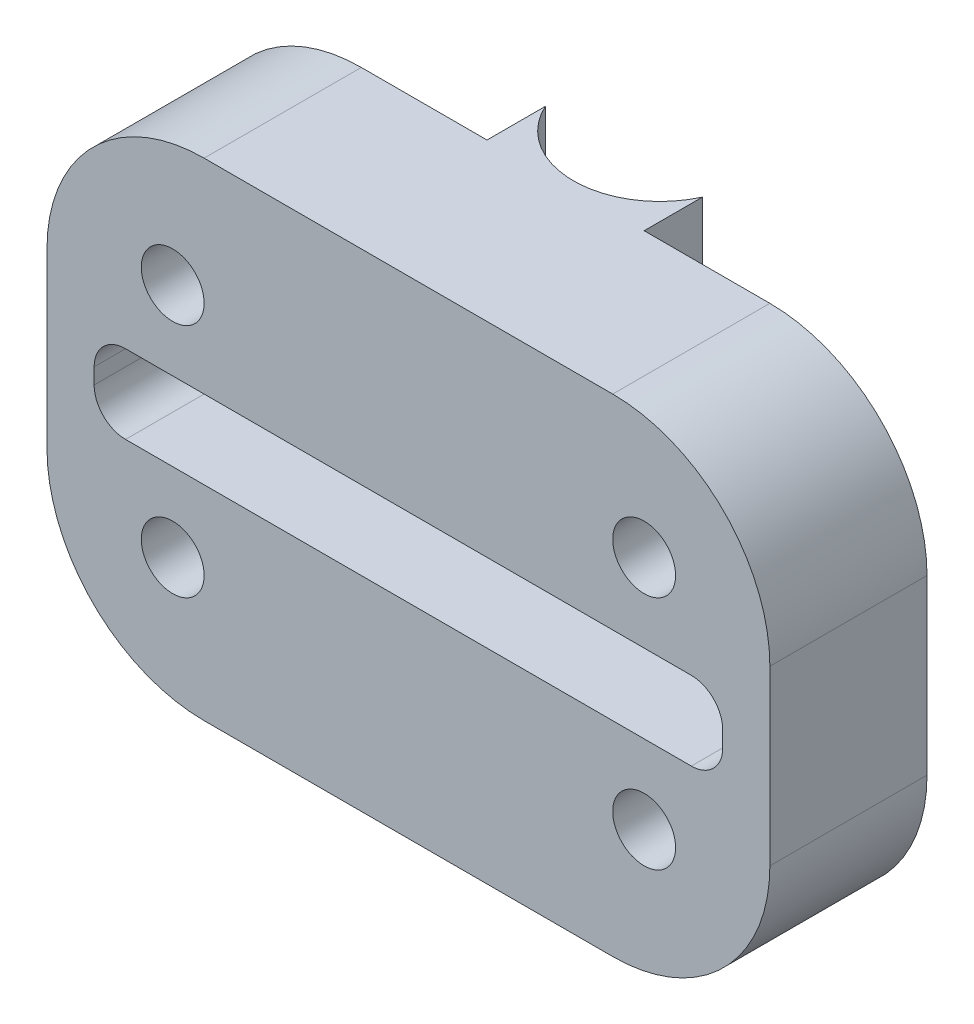
ISO-10303-21;
HEADER;
FILE_DESCRIPTION(('STEP AP214'),'2;1');
FILE_NAME('part.step','',(''),(''),'','','');
FILE_SCHEMA(('AUTOMOTIVE_DESIGN { 1 0 10303 214 1 1 1 1 }'));
ENDSEC;
DATA;
#1=APPLICATION_CONTEXT('core data for automotive mechanical design processes');
#2=APPLICATION_PROTOCOL_DEFINITION('international standard','automotive_design',2000,#1);
#3=PRODUCT_CONTEXT('',#1,'mechanical');
#4=PRODUCT('Part','Part','',(#3));
#5=PRODUCT_RELATED_PRODUCT_CATEGORY('part','',(#4));
#6=PRODUCT_DEFINITION_FORMATION('','',#4);
#7=PRODUCT_DEFINITION_CONTEXT('part definition',#1,'design');
#8=PRODUCT_DEFINITION('design','',#6,#7);
#9=PRODUCT_DEFINITION_SHAPE('','',#8);
#10=(LENGTH_UNIT() NAMED_UNIT(*) SI_UNIT(.MILLI.,.METRE.));
#11=(NAMED_UNIT(*) PLANE_ANGLE_UNIT() SI_UNIT($,.RADIAN.));
#12=(NAMED_UNIT(*) SI_UNIT($,.STERADIAN.) SOLID_ANGLE_UNIT());
#13=UNCERTAINTY_MEASURE_WITH_UNIT(LENGTH_MEASURE(1.E-05),#10,'distance_accuracy_value','');
#14=(GEOMETRIC_REPRESENTATION_CONTEXT(3) GLOBAL_UNCERTAINTY_ASSIGNED_CONTEXT((#13)) GLOBAL_UNIT_ASSIGNED_CONTEXT((#10,
#11,#12)) REPRESENTATION_CONTEXT('',''));
#15=CARTESIAN_POINT('',(0.,0.,0.));
#16=DIRECTION('',(0.,0.,1.));
#17=DIRECTION('',(1.,0.,0.));
#18=AXIS2_PLACEMENT_3D('',#15,#16,#17);
#19=CARTESIAN_POINT('',(0.,0.,0.));
#20=DIRECTION('',(0.,0.,1.));
#21=DIRECTION('',(1.,0.,0.));
#22=AXIS2_PLACEMENT_3D('',#19,#20,#21);
#23=PLANE('',#22);
#24=DIRECTION('',(0.,1.,0.));
#25=VECTOR('',#24,1.);
#26=CARTESIAN_POINT('',(20.,0.,0.));
#27=LINE('',#26,#25);
#28=CARTESIAN_POINT('',(20.,-0.5,0.));
#29=VERTEX_POINT('',#28);
#30=CARTESIAN_POINT('',(20.,0.5,0.));
#31=VERTEX_POINT('',#30);
#32=EDGE_CURVE('E387',#29,#31,#27,.T.);
#33=ORIENTED_EDGE('',*,*,#32,.T.);
#34=CARTESIAN_POINT('',(18.,0.5,0.));
#35=DIRECTION('',(0.,0.,1.));
#36=DIRECTION('',(1.,0.,0.));
#37=AXIS2_PLACEMENT_3D('',#34,#35,#36);
#38=CIRCLE('',#37,2.);
#39=CARTESIAN_POINT('',(18.,2.5,0.));
#40=VERTEX_POINT('',#39);
#41=EDGE_CURVE('E58',#31,#40,#38,.T.);
#42=ORIENTED_EDGE('',*,*,#41,.T.);
#43=DIRECTION('',(-1.,0.,0.));
#44=VECTOR('',#43,1.);
#45=CARTESIAN_POINT('',(0.,2.5,0.));
#46=LINE('',#45,#44);
#47=CARTESIAN_POINT('',(-18.,2.5,0.));
#48=VERTEX_POINT('',#47);
#49=EDGE_CURVE('E398',#40,#48,#46,.T.);
#50=ORIENTED_EDGE('',*,*,#49,.T.);
#51=CARTESIAN_POINT('',(-18.,0.5,0.));
#52=DIRECTION('',(0.,0.,1.));
#53=DIRECTION('',(1.,0.,0.));
#54=AXIS2_PLACEMENT_3D('',#51,#52,#53);
#55=CIRCLE('',#54,2.);
#56=CARTESIAN_POINT('',(-20.,0.5,0.));
#57=VERTEX_POINT('',#56);
#58=EDGE_CURVE('E50',#48,#57,#55,.T.);
#59=ORIENTED_EDGE('',*,*,#58,.T.);
#60=DIRECTION('',(0.,-1.,0.));
#61=VECTOR('',#60,1.);
#62=CARTESIAN_POINT('',(-20.,0.,0.));
#63=LINE('',#62,#61);
#64=CARTESIAN_POINT('',(-20.,-0.5,0.));
#65=VERTEX_POINT('',#64);
#66=EDGE_CURVE('E231',#57,#65,#63,.T.);
#67=ORIENTED_EDGE('',*,*,#66,.T.);
#68=CARTESIAN_POINT('',(-18.,-0.5,0.));
#69=DIRECTION('',(0.,0.,1.));
#70=DIRECTION('',(1.,0.,0.));
#71=AXIS2_PLACEMENT_3D('',#68,#69,#70);
#72=CIRCLE('',#71,2.);
#73=CARTESIAN_POINT('',(-18.,-2.5,0.));
#74=VERTEX_POINT('',#73);
#75=EDGE_CURVE('E375',#65,#74,#72,.T.);
#76=ORIENTED_EDGE('',*,*,#75,.T.);
#77=DIRECTION('',(1.,0.,0.));
#78=VECTOR('',#77,1.);
#79=CARTESIAN_POINT('',(0.,-2.5,0.));
#80=LINE('',#79,#78);
#81=CARTESIAN_POINT('',(18.,-2.5,0.));
#82=VERTEX_POINT('',#81);
#83=EDGE_CURVE('E389',#74,#82,#80,.T.);
#84=ORIENTED_EDGE('',*,*,#83,.T.);
#85=CARTESIAN_POINT('',(18.,-0.5,0.));
#86=DIRECTION('',(0.,0.,1.));
#87=DIRECTION('',(1.,0.,0.));
#88=AXIS2_PLACEMENT_3D('',#85,#86,#87);
#89=CIRCLE('',#88,2.);
#90=EDGE_CURVE('E43',#82,#29,#89,.T.);
#91=ORIENTED_EDGE('',*,*,#90,.T.);
#92=EDGE_LOOP('',(#33,#42,#50,#59,#67,#76,#84,#91));
#93=FACE_BOUND('',#92,.T.);
#94=CARTESIAN_POINT('',(-15.,7.5,0.));
#95=DIRECTION('',(0.,0.,1.));
#96=DIRECTION('',(1.,0.,0.));
#97=AXIS2_PLACEMENT_3D('',#94,#95,#96);
#98=CIRCLE('',#97,2.);
#99=CARTESIAN_POINT('',(-13.,7.5,0.));
#100=VERTEX_POINT('',#99);
#101=EDGE_CURVE('E284',#100,#100,#98,.T.);
#102=ORIENTED_EDGE('',*,*,#101,.T.);
#103=EDGE_LOOP('',(#102));
#104=FACE_BOUND('',#103,.T.);
#105=CARTESIAN_POINT('',(15.,7.5,0.));
#106=DIRECTION('',(0.,0.,1.));
#107=DIRECTION('',(1.,0.,0.));
#108=AXIS2_PLACEMENT_3D('',#105,#106,#107);
#109=CIRCLE('',#108,2.);
#110=CARTESIAN_POINT('',(17.,7.5,0.));
#111=VERTEX_POINT('',#110);
#112=EDGE_CURVE('E278',#111,#111,#109,.T.);
#113=ORIENTED_EDGE('',*,*,#112,.T.);
#114=EDGE_LOOP('',(#113));
#115=FACE_BOUND('',#114,.T.);
#116=CARTESIAN_POINT('',(15.,-7.5,0.));
#117=DIRECTION('',(0.,0.,1.));
#118=DIRECTION('',(1.,0.,0.));
#119=AXIS2_PLACEMENT_3D('',#116,#117,#118);
#120=CIRCLE('',#119,2.);
#121=CARTESIAN_POINT('',(17.,-7.5,0.));
#122=VERTEX_POINT('',#121);
#123=EDGE_CURVE('E272',#122,#122,#120,.T.);
#124=ORIENTED_EDGE('',*,*,#123,.T.);
#125=EDGE_LOOP('',(#124));
#126=FACE_BOUND('',#125,.T.);
#127=CARTESIAN_POINT('',(-15.,-7.5,0.));
#128=DIRECTION('',(0.,0.,1.));
#129=DIRECTION('',(1.,0.,0.));
#130=AXIS2_PLACEMENT_3D('',#127,#128,#129);
#131=CIRCLE('',#130,2.);
#132=CARTESIAN_POINT('',(-13.,-7.5,0.));
#133=VERTEX_POINT('',#132);
#134=EDGE_CURVE('E262',#133,#133,#131,.T.);
#135=ORIENTED_EDGE('',*,*,#134,.T.);
#136=EDGE_LOOP('',(#135));
#137=FACE_BOUND('',#136,.T.);
#138=DIRECTION('',(0.,-1.,0.));
#139=VECTOR('',#138,1.);
#140=CARTESIAN_POINT('',(5.,-5.5,0.));
#141=LINE('',#140,#139);
#142=CARTESIAN_POINT('',(5.,-5.5,0.));
#143=VERTEX_POINT('',#142);
#144=CARTESIAN_POINT('',(5.,-15.5,0.));
#145=VERTEX_POINT('',#144);
#146=EDGE_CURVE('E228',#143,#145,#141,.T.);
#147=ORIENTED_EDGE('',*,*,#146,.F.);
#148=DIRECTION('',(1.,0.,0.));
#149=VECTOR('',#148,1.);
#150=CARTESIAN_POINT('',(-23.,-5.5,0.));
#151=LINE('',#150,#149);
#152=CARTESIAN_POINT('',(-5.,-5.5,0.));
#153=VERTEX_POINT('',#152);
#154=EDGE_CURVE('E205',#153,#143,#151,.T.);
#155=ORIENTED_EDGE('',*,*,#154,.F.);
#156=DIRECTION('',(0.,-1.,0.));
#157=VECTOR('',#156,1.);
#158=CARTESIAN_POINT('',(-5.,-5.5,0.));
#159=LINE('',#158,#157);
#160=CARTESIAN_POINT('',(-5.,-15.5,0.));
#161=VERTEX_POINT('',#160);
#162=EDGE_CURVE('E236',#153,#161,#159,.T.);
#163=ORIENTED_EDGE('',*,*,#162,.T.);
#164=DIRECTION('',(1.,0.,0.));
#165=VECTOR('',#164,1.);
#166=CARTESIAN_POINT('',(-23.,-15.5,0.));
#167=LINE('',#166,#165);
#168=CARTESIAN_POINT('',(-13.,-15.5,0.));
#169=VERTEX_POINT('',#168);
#170=EDGE_CURVE('E297',#169,#161,#167,.T.);
#171=ORIENTED_EDGE('',*,*,#170,.F.);
#172=CARTESIAN_POINT('',(-13.,-5.5,0.));
#173=DIRECTION('',(0.,0.,1.));
#174=DIRECTION('',(1.,0.,0.));
#175=AXIS2_PLACEMENT_3D('',#172,#173,#174);
#176=CIRCLE('',#175,10.);
#177=CARTESIAN_POINT('',(-23.,-5.49999999999999,0.));
#178=VERTEX_POINT('',#177);
#179=EDGE_CURVE('E323',#169,#178,#176,.F.);
#180=ORIENTED_EDGE('',*,*,#179,.T.);
#181=DIRECTION('',(0.,-1.,0.));
#182=VECTOR('',#181,1.);
#183=CARTESIAN_POINT('',(-23.,15.5,0.));
#184=LINE('',#183,#182);
#185=CARTESIAN_POINT('',(-23.,5.5,0.));
#186=VERTEX_POINT('',#185);
#187=EDGE_CURVE('E313',#186,#178,#184,.T.);
#188=ORIENTED_EDGE('',*,*,#187,.F.);
#189=CARTESIAN_POINT('',(-13.,5.5,0.));
#190=DIRECTION('',(0.,0.,1.));
#191=DIRECTION('',(1.,0.,0.));
#192=AXIS2_PLACEMENT_3D('',#189,#190,#191);
#193=CIRCLE('',#192,10.);
#194=CARTESIAN_POINT('',(-13.,15.5,0.));
#195=VERTEX_POINT('',#194);
#196=EDGE_CURVE('E330',#186,#195,#193,.F.);
#197=ORIENTED_EDGE('',*,*,#196,.T.);
#198=DIRECTION('',(-1.,0.,0.));
#199=VECTOR('',#198,1.);
#200=CARTESIAN_POINT('',(-23.,15.5,0.));
#201=LINE('',#200,#199);
#202=CARTESIAN_POINT('',(-5.,15.5,0.));
#203=VERTEX_POINT('',#202);
#204=EDGE_CURVE('E309',#203,#195,#201,.T.);
#205=ORIENTED_EDGE('',*,*,#204,.F.);
#206=DIRECTION('',(0.,1.,0.));
#207=VECTOR('',#206,1.);
#208=CARTESIAN_POINT('',(-5.,5.5,0.));
#209=LINE('',#208,#207);
#210=CARTESIAN_POINT('',(-5.,5.5,0.));
#211=VERTEX_POINT('',#210);
#212=EDGE_CURVE('E266',#211,#203,#209,.T.);
#213=ORIENTED_EDGE('',*,*,#212,.F.);
#214=DIRECTION('',(1.,0.,0.));
#215=VECTOR('',#214,1.);
#216=CARTESIAN_POINT('',(-23.,5.5,0.));
#217=LINE('',#216,#215);
#218=CARTESIAN_POINT('',(5.,5.5,0.));
#219=VERTEX_POINT('',#218);
#220=EDGE_CURVE('E246',#211,#219,#217,.T.);
#221=ORIENTED_EDGE('',*,*,#220,.T.);
#222=DIRECTION('',(0.,1.,0.));
#223=VECTOR('',#222,1.);
#224=CARTESIAN_POINT('',(5.,5.5,0.));
#225=LINE('',#224,#223);
#226=CARTESIAN_POINT('',(5.,15.5,0.));
#227=VERTEX_POINT('',#226);
#228=EDGE_CURVE('E263',#219,#227,#225,.T.);
#229=ORIENTED_EDGE('',*,*,#228,.T.);
#230=CARTESIAN_POINT('',(13.,15.5,0.));
#231=VERTEX_POINT('',#230);
#232=EDGE_CURVE('E310',#231,#227,#201,.T.);
#233=ORIENTED_EDGE('',*,*,#232,.F.);
#234=CARTESIAN_POINT('',(13.,5.5,0.));
#235=DIRECTION('',(0.,0.,1.));
#236=DIRECTION('',(1.,0.,0.));
#237=AXIS2_PLACEMENT_3D('',#234,#235,#236);
#238=CIRCLE('',#237,10.);
#239=CARTESIAN_POINT('',(23.,5.50000000000001,0.));
#240=VERTEX_POINT('',#239);
#241=EDGE_CURVE('E328',#231,#240,#238,.F.);
#242=ORIENTED_EDGE('',*,*,#241,.T.);
#243=DIRECTION('',(0.,1.,0.));
#244=VECTOR('',#243,1.);
#245=CARTESIAN_POINT('',(23.,15.5,0.));
#246=LINE('',#245,#244);
#247=CARTESIAN_POINT('',(23.,-5.49999999999999,0.));
#248=VERTEX_POINT('',#247);
#249=EDGE_CURVE('E290',#248,#240,#246,.T.);
#250=ORIENTED_EDGE('',*,*,#249,.F.);
#251=CARTESIAN_POINT('',(13.,-5.5,0.));
#252=DIRECTION('',(0.,0.,1.));
#253=DIRECTION('',(1.,0.,0.));
#254=AXIS2_PLACEMENT_3D('',#251,#252,#253);
#255=CIRCLE('',#254,10.);
#256=CARTESIAN_POINT('',(13.,-15.5,0.));
#257=VERTEX_POINT('',#256);
#258=EDGE_CURVE('E325',#248,#257,#255,.F.);
#259=ORIENTED_EDGE('',*,*,#258,.T.);
#260=EDGE_CURVE('E316',#145,#257,#167,.T.);
#261=ORIENTED_EDGE('',*,*,#260,.F.);
#262=EDGE_LOOP('',(#147,#155,#163,#171,#180,#188,#197,#205,#213,#221,#229,#233,#242,#250,#259,#261));
#263=FACE_BOUND('',#262,.T.);
#264=ADVANCED_FACE('F35',(#93,#104,#115,#126,#137,#263),#23,.F.);
#265=CARTESIAN_POINT('',(0.,0.,10.));
#266=DIRECTION('',(0.,0.,1.));
#267=DIRECTION('',(1.,0.,0.));
#268=AXIS2_PLACEMENT_3D('',#265,#266,#267);
#269=PLANE('',#268);
#270=DIRECTION('',(-1.,0.,0.));
#271=VECTOR('',#270,1.);
#272=CARTESIAN_POINT('',(20.,-2.5,10.));
#273=LINE('',#272,#271);
#274=CARTESIAN_POINT('',(18.,-2.5,10.));
#275=VERTEX_POINT('',#274);
#276=CARTESIAN_POINT('',(-18.,-2.5,10.));
#277=VERTEX_POINT('',#276);
#278=EDGE_CURVE('E406',#275,#277,#273,.T.);
#279=ORIENTED_EDGE('',*,*,#278,.T.);
#280=CARTESIAN_POINT('',(-18.,-0.5,10.));
#281=DIRECTION('',(0.,0.,1.));
#282=DIRECTION('',(1.,0.,0.));
#283=AXIS2_PLACEMENT_3D('',#280,#281,#282);
#284=CIRCLE('',#283,2.);
#285=CARTESIAN_POINT('',(-20.,-0.5,10.));
#286=VERTEX_POINT('',#285);
#287=EDGE_CURVE('E377',#277,#286,#284,.F.);
#288=ORIENTED_EDGE('',*,*,#287,.T.);
#289=DIRECTION('',(0.,1.,0.));
#290=VECTOR('',#289,1.);
#291=CARTESIAN_POINT('',(-20.,2.5,10.));
#292=LINE('',#291,#290);
#293=CARTESIAN_POINT('',(-20.,0.5,10.));
#294=VERTEX_POINT('',#293);
#295=EDGE_CURVE('E430',#286,#294,#292,.T.);
#296=ORIENTED_EDGE('',*,*,#295,.T.);
#297=CARTESIAN_POINT('',(-18.,0.5,10.));
#298=DIRECTION('',(0.,0.,1.));
#299=DIRECTION('',(1.,0.,0.));
#300=AXIS2_PLACEMENT_3D('',#297,#298,#299);
#301=CIRCLE('',#300,2.);
#302=CARTESIAN_POINT('',(-18.,2.5,10.));
#303=VERTEX_POINT('',#302);
#304=EDGE_CURVE('E383',#294,#303,#301,.F.);
#305=ORIENTED_EDGE('',*,*,#304,.T.);
#306=DIRECTION('',(1.,0.,0.));
#307=VECTOR('',#306,1.);
#308=CARTESIAN_POINT('',(20.,2.5,10.));
#309=LINE('',#308,#307);
#310=CARTESIAN_POINT('',(18.,2.5,10.));
#311=VERTEX_POINT('',#310);
#312=EDGE_CURVE('E414',#303,#311,#309,.T.);
#313=ORIENTED_EDGE('',*,*,#312,.T.);
#314=CARTESIAN_POINT('',(18.,0.5,10.));
#315=DIRECTION('',(0.,0.,1.));
#316=DIRECTION('',(1.,0.,0.));
#317=AXIS2_PLACEMENT_3D('',#314,#315,#316);
#318=CIRCLE('',#317,2.);
#319=CARTESIAN_POINT('',(20.,0.5,10.));
#320=VERTEX_POINT('',#319);
#321=EDGE_CURVE('E380',#311,#320,#318,.F.);
#322=ORIENTED_EDGE('',*,*,#321,.T.);
#323=DIRECTION('',(0.,-1.,0.));
#324=VECTOR('',#323,1.);
#325=CARTESIAN_POINT('',(20.,2.5,10.));
#326=LINE('',#325,#324);
#327=CARTESIAN_POINT('',(20.,-0.5,10.));
#328=VERTEX_POINT('',#327);
#329=EDGE_CURVE('E408',#320,#328,#326,.T.);
#330=ORIENTED_EDGE('',*,*,#329,.T.);
#331=CARTESIAN_POINT('',(18.,-0.5,10.));
#332=DIRECTION('',(0.,0.,1.));
#333=DIRECTION('',(1.,0.,0.));
#334=AXIS2_PLACEMENT_3D('',#331,#332,#333);
#335=CIRCLE('',#334,2.);
#336=EDGE_CURVE('E11',#328,#275,#335,.F.);
#337=ORIENTED_EDGE('',*,*,#336,.T.);
#338=EDGE_LOOP('',(#279,#288,#296,#305,#313,#322,#330,#337));
#339=FACE_BOUND('',#338,.T.);
#340=CARTESIAN_POINT('',(15.,-7.5,10.));
#341=DIRECTION('',(0.,0.,1.));
#342=DIRECTION('',(1.,0.,0.));
#343=AXIS2_PLACEMENT_3D('',#340,#341,#342);
#344=CIRCLE('',#343,2.);
#345=CARTESIAN_POINT('',(17.,-7.5,10.));
#346=VERTEX_POINT('',#345);
#347=EDGE_CURVE('E275',#346,#346,#344,.T.);
#348=ORIENTED_EDGE('',*,*,#347,.F.);
#349=EDGE_LOOP('',(#348));
#350=FACE_BOUND('',#349,.T.);
#351=CARTESIAN_POINT('',(-15.,7.5,10.));
#352=DIRECTION('',(0.,0.,1.));
#353=DIRECTION('',(1.,0.,0.));
#354=AXIS2_PLACEMENT_3D('',#351,#352,#353);
#355=CIRCLE('',#354,2.);
#356=CARTESIAN_POINT('',(-13.,7.5,10.));
#357=VERTEX_POINT('',#356);
#358=EDGE_CURVE('E287',#357,#357,#355,.T.);
#359=ORIENTED_EDGE('',*,*,#358,.F.);
#360=EDGE_LOOP('',(#359));
#361=FACE_BOUND('',#360,.T.);
#362=DIRECTION('',(-1.,0.,0.));
#363=VECTOR('',#362,1.);
#364=CARTESIAN_POINT('',(-23.,15.5,10.));
#365=LINE('',#364,#363);
#366=CARTESIAN_POINT('',(13.,15.5,10.));
#367=VERTEX_POINT('',#366);
#368=CARTESIAN_POINT('',(-13.,15.5,10.));
#369=VERTEX_POINT('',#368);
#370=EDGE_CURVE('E296',#367,#369,#365,.T.);
#371=ORIENTED_EDGE('',*,*,#370,.T.);
#372=CARTESIAN_POINT('',(-13.,5.5,10.));
#373=DIRECTION('',(0.,0.,1.));
#374=DIRECTION('',(1.,0.,0.));
#375=AXIS2_PLACEMENT_3D('',#372,#373,#374);
#376=CIRCLE('',#375,10.);
#377=CARTESIAN_POINT('',(-23.,5.5,10.));
#378=VERTEX_POINT('',#377);
#379=EDGE_CURVE('E344',#369,#378,#376,.T.);
#380=ORIENTED_EDGE('',*,*,#379,.T.);
#381=DIRECTION('',(0.,-1.,0.));
#382=VECTOR('',#381,1.);
#383=CARTESIAN_POINT('',(-23.,15.5,10.));
#384=LINE('',#383,#382);
#385=CARTESIAN_POINT('',(-23.,-5.49999999999999,10.));
#386=VERTEX_POINT('',#385);
#387=EDGE_CURVE('E300',#378,#386,#384,.T.);
#388=ORIENTED_EDGE('',*,*,#387,.T.);
#389=CARTESIAN_POINT('',(-13.,-5.5,10.));
#390=DIRECTION('',(0.,0.,1.));
#391=DIRECTION('',(1.,0.,0.));
#392=AXIS2_PLACEMENT_3D('',#389,#390,#391);
#393=CIRCLE('',#392,10.);
#394=CARTESIAN_POINT('',(-13.,-15.5,10.));
#395=VERTEX_POINT('',#394);
#396=EDGE_CURVE('E338',#386,#395,#393,.T.);
#397=ORIENTED_EDGE('',*,*,#396,.T.);
#398=DIRECTION('',(1.,0.,0.));
#399=VECTOR('',#398,1.);
#400=CARTESIAN_POINT('',(-23.,-15.5,10.));
#401=LINE('',#400,#399);
#402=CARTESIAN_POINT('',(13.,-15.5,10.));
#403=VERTEX_POINT('',#402);
#404=EDGE_CURVE('E303',#395,#403,#401,.T.);
#405=ORIENTED_EDGE('',*,*,#404,.T.);
#406=CARTESIAN_POINT('',(13.,-5.5,10.));
#407=DIRECTION('',(0.,0.,1.));
#408=DIRECTION('',(1.,0.,0.));
#409=AXIS2_PLACEMENT_3D('',#406,#407,#408);
#410=CIRCLE('',#409,10.);
#411=CARTESIAN_POINT('',(23.,-5.49999999999999,10.));
#412=VERTEX_POINT('',#411);
#413=EDGE_CURVE('E340',#403,#412,#410,.T.);
#414=ORIENTED_EDGE('',*,*,#413,.T.);
#415=DIRECTION('',(0.,1.,0.));
#416=VECTOR('',#415,1.);
#417=CARTESIAN_POINT('',(23.,15.5,10.));
#418=LINE('',#417,#416);
#419=CARTESIAN_POINT('',(23.,5.50000000000001,10.));
#420=VERTEX_POINT('',#419);
#421=EDGE_CURVE('E293',#412,#420,#418,.T.);
#422=ORIENTED_EDGE('',*,*,#421,.T.);
#423=CARTESIAN_POINT('',(13.,5.5,10.));
#424=DIRECTION('',(0.,0.,1.));
#425=DIRECTION('',(1.,0.,0.));
#426=AXIS2_PLACEMENT_3D('',#423,#424,#425);
#427=CIRCLE('',#426,10.);
#428=EDGE_CURVE('E342',#420,#367,#427,.T.);
#429=ORIENTED_EDGE('',*,*,#428,.T.);
#430=EDGE_LOOP('',(#371,#380,#388,#397,#405,#414,#422,#429));
#431=FACE_BOUND('',#430,.T.);
#432=CARTESIAN_POINT('',(15.,7.5,10.));
#433=DIRECTION('',(0.,0.,1.));
#434=DIRECTION('',(1.,0.,0.));
#435=AXIS2_PLACEMENT_3D('',#432,#433,#434);
#436=CIRCLE('',#435,2.);
#437=CARTESIAN_POINT('',(17.,7.5,10.));
#438=VERTEX_POINT('',#437);
#439=EDGE_CURVE('E281',#438,#438,#436,.T.);
#440=ORIENTED_EDGE('',*,*,#439,.F.);
#441=EDGE_LOOP('',(#440));
#442=FACE_BOUND('',#441,.T.);
#443=CARTESIAN_POINT('',(-15.,-7.5,10.));
#444=DIRECTION('',(0.,0.,1.));
#445=DIRECTION('',(1.,0.,0.));
#446=AXIS2_PLACEMENT_3D('',#443,#444,#445);
#447=CIRCLE('',#446,2.);
#448=CARTESIAN_POINT('',(-13.,-7.5,10.));
#449=VERTEX_POINT('',#448);
#450=EDGE_CURVE('E269',#449,#449,#447,.T.);
#451=ORIENTED_EDGE('',*,*,#450,.F.);
#452=EDGE_LOOP('',(#451));
#453=FACE_BOUND('',#452,.T.);
#454=ADVANCED_FACE('F404',(#339,#350,#361,#431,#442,#453),#269,.T.);
#455=CARTESIAN_POINT('',(23.,15.5,10.));
#456=DIRECTION('',(-1.,0.,0.));
#457=DIRECTION('',(0.,-1.,0.));
#458=AXIS2_PLACEMENT_3D('',#455,#456,#457);
#459=PLANE('',#458);
#460=ORIENTED_EDGE('',*,*,#249,.T.);
#461=DIRECTION('',(0.,0.,-1.));
#462=VECTOR('',#461,1.);
#463=CARTESIAN_POINT('',(23.,5.50000000000001,10.));
#464=LINE('',#463,#462);
#465=EDGE_CURVE('E349',#240,#420,#464,.F.);
#466=ORIENTED_EDGE('',*,*,#465,.T.);
#467=ORIENTED_EDGE('',*,*,#421,.F.);
#468=DIRECTION('',(0.,0.,-1.));
#469=VECTOR('',#468,1.);
#470=CARTESIAN_POINT('',(23.,-5.49999999999999,10.));
#471=LINE('',#470,#469);
#472=EDGE_CURVE('E346',#412,#248,#471,.T.);
#473=ORIENTED_EDGE('',*,*,#472,.T.);
#474=EDGE_LOOP('',(#460,#466,#467,#473));
#475=FACE_BOUND('',#474,.T.);
#476=ADVANCED_FACE('F451',(#475),#459,.F.);
#477=CARTESIAN_POINT('',(-23.,15.5,10.));
#478=DIRECTION('',(0.,-1.,0.));
#479=DIRECTION('',(0.,0.,-1.));
#480=AXIS2_PLACEMENT_3D('',#477,#478,#479);
#481=PLANE('',#480);
#482=ORIENTED_EDGE('',*,*,#232,.T.);
#483=DIRECTION('',(0.,0.,-1.));
#484=VECTOR('',#483,1.);
#485=CARTESIAN_POINT('',(5.,15.5,9.99999999999999));
#486=LINE('',#485,#484);
#487=CARTESIAN_POINT('',(5.,15.5,-3.70871215252208));
#488=VERTEX_POINT('',#487);
#489=EDGE_CURVE('E244',#227,#488,#486,.T.);
#490=ORIENTED_EDGE('',*,*,#489,.T.);
#491=CARTESIAN_POINT('',(0.,15.5,-6.));
#492=DIRECTION('',(0.,-1.,0.));
#493=DIRECTION('',(0.,0.,-1.));
#494=AXIS2_PLACEMENT_3D('',#491,#492,#493);
#495=CIRCLE('',#494,5.5);
#496=CARTESIAN_POINT('',(-5.,15.5,-3.70871215252208));
#497=VERTEX_POINT('',#496);
#498=EDGE_CURVE('E218',#488,#497,#495,.T.);
#499=ORIENTED_EDGE('',*,*,#498,.T.);
#500=DIRECTION('',(0.,0.,-1.));
#501=VECTOR('',#500,1.);
#502=CARTESIAN_POINT('',(-5.,15.5,10.));
#503=LINE('',#502,#501);
#504=EDGE_CURVE('E255',#203,#497,#503,.T.);
#505=ORIENTED_EDGE('',*,*,#504,.F.);
#506=ORIENTED_EDGE('',*,*,#204,.T.);
#507=DIRECTION('',(0.,0.,-1.));
#508=VECTOR('',#507,1.);
#509=CARTESIAN_POINT('',(-13.,15.5,10.));
#510=LINE('',#509,#508);
#511=EDGE_CURVE('E336',#195,#369,#510,.F.);
#512=ORIENTED_EDGE('',*,*,#511,.T.);
#513=ORIENTED_EDGE('',*,*,#370,.F.);
#514=DIRECTION('',(0.,0.,-1.));
#515=VECTOR('',#514,1.);
#516=CARTESIAN_POINT('',(13.,15.5,10.));
#517=LINE('',#516,#515);
#518=EDGE_CURVE('E333',#367,#231,#517,.T.);
#519=ORIENTED_EDGE('',*,*,#518,.T.);
#520=EDGE_LOOP('',(#482,#490,#499,#505,#506,#512,#513,#519));
#521=FACE_BOUND('',#520,.T.);
#522=ADVANCED_FACE('F463',(#521),#481,.F.);
#523=CARTESIAN_POINT('',(-23.,15.5,10.));
#524=DIRECTION('',(1.,0.,0.));
#525=DIRECTION('',(0.,0.,-1.));
#526=AXIS2_PLACEMENT_3D('',#523,#524,#525);
#527=PLANE('',#526);
#528=ORIENTED_EDGE('',*,*,#387,.F.);
#529=DIRECTION('',(0.,0.,-1.));
#530=VECTOR('',#529,1.);
#531=CARTESIAN_POINT('',(-23.,5.5,10.));
#532=LINE('',#531,#530);
#533=EDGE_CURVE('E320',#378,#186,#532,.T.);
#534=ORIENTED_EDGE('',*,*,#533,.T.);
#535=ORIENTED_EDGE('',*,*,#187,.T.);
#536=DIRECTION('',(0.,0.,-1.));
#537=VECTOR('',#536,1.);
#538=CARTESIAN_POINT('',(-23.,-5.49999999999999,10.));
#539=LINE('',#538,#537);
#540=EDGE_CURVE('E306',#178,#386,#539,.F.);
#541=ORIENTED_EDGE('',*,*,#540,.T.);
#542=EDGE_LOOP('',(#528,#534,#535,#541));
#543=FACE_BOUND('',#542,.T.);
#544=ADVANCED_FACE('F459',(#543),#527,.F.);
#545=CARTESIAN_POINT('',(-23.,-15.5,10.));
#546=DIRECTION('',(0.,1.,0.));
#547=DIRECTION('',(0.,0.,1.));
#548=AXIS2_PLACEMENT_3D('',#545,#546,#547);
#549=PLANE('',#548);
#550=ORIENTED_EDGE('',*,*,#170,.T.);
#551=DIRECTION('',(0.,0.,-1.));
#552=VECTOR('',#551,1.);
#553=CARTESIAN_POINT('',(-5.,-15.5,10.));
#554=LINE('',#553,#552);
#555=CARTESIAN_POINT('',(-5.,-15.5,-3.70871215252208));
#556=VERTEX_POINT('',#555);
#557=EDGE_CURVE('E209',#161,#556,#554,.T.);
#558=ORIENTED_EDGE('',*,*,#557,.T.);
#559=CARTESIAN_POINT('',(0.,-15.5,-6.));
#560=DIRECTION('',(0.,1.,0.));
#561=DIRECTION('',(0.,0.,1.));
#562=AXIS2_PLACEMENT_3D('',#559,#560,#561);
#563=CIRCLE('',#562,5.5);
#564=CARTESIAN_POINT('',(5.,-15.5,-3.70871215252208));
#565=VERTEX_POINT('',#564);
#566=EDGE_CURVE('E230',#556,#565,#563,.T.);
#567=ORIENTED_EDGE('',*,*,#566,.T.);
#568=DIRECTION('',(0.,0.,-1.));
#569=VECTOR('',#568,1.);
#570=CARTESIAN_POINT('',(5.,-15.5,9.99999999999999));
#571=LINE('',#570,#569);
#572=EDGE_CURVE('E214',#145,#565,#571,.T.);
#573=ORIENTED_EDGE('',*,*,#572,.F.);
#574=ORIENTED_EDGE('',*,*,#260,.T.);
#575=DIRECTION('',(0.,0.,-1.));
#576=VECTOR('',#575,1.);
#577=CARTESIAN_POINT('',(13.,-15.5,10.));
#578=LINE('',#577,#576);
#579=EDGE_CURVE('E354',#257,#403,#578,.F.);
#580=ORIENTED_EDGE('',*,*,#579,.T.);
#581=ORIENTED_EDGE('',*,*,#404,.F.);
#582=DIRECTION('',(0.,0.,-1.));
#583=VECTOR('',#582,1.);
#584=CARTESIAN_POINT('',(-13.,-15.5,10.));
#585=LINE('',#584,#583);
#586=EDGE_CURVE('E351',#395,#169,#585,.T.);
#587=ORIENTED_EDGE('',*,*,#586,.T.);
#588=EDGE_LOOP('',(#550,#558,#567,#573,#574,#580,#581,#587));
#589=FACE_BOUND('',#588,.T.);
#590=ADVANCED_FACE('F455',(#589),#549,.F.);
#591=CARTESIAN_POINT('',(-15.,7.5,10.));
#592=DIRECTION('',(0.,0.,-1.));
#593=DIRECTION('',(-1.,0.,0.));
#594=AXIS2_PLACEMENT_3D('',#591,#592,#593);
#595=CYLINDRICAL_SURFACE('',#594,2.);
#596=ORIENTED_EDGE('',*,*,#358,.T.);
#597=EDGE_LOOP('',(#596));
#598=FACE_BOUND('',#597,.T.);
#599=ORIENTED_EDGE('',*,*,#101,.F.);
#600=EDGE_LOOP('',(#599));
#601=FACE_BOUND('',#600,.T.);
#602=ADVANCED_FACE('F458',(#598,#601),#595,.F.);
#603=CARTESIAN_POINT('',(15.,7.5,10.));
#604=DIRECTION('',(0.,0.,-1.));
#605=DIRECTION('',(-1.,0.,0.));
#606=AXIS2_PLACEMENT_3D('',#603,#604,#605);
#607=CYLINDRICAL_SURFACE('',#606,2.);
#608=ORIENTED_EDGE('',*,*,#439,.T.);
#609=EDGE_LOOP('',(#608));
#610=FACE_BOUND('',#609,.T.);
#611=ORIENTED_EDGE('',*,*,#112,.F.);
#612=EDGE_LOOP('',(#611));
#613=FACE_BOUND('',#612,.T.);
#614=ADVANCED_FACE('F551',(#610,#613),#607,.F.);
#615=CARTESIAN_POINT('',(15.,-7.5,10.));
#616=DIRECTION('',(0.,0.,-1.));
#617=DIRECTION('',(-1.,0.,0.));
#618=AXIS2_PLACEMENT_3D('',#615,#616,#617);
#619=CYLINDRICAL_SURFACE('',#618,2.);
#620=ORIENTED_EDGE('',*,*,#347,.T.);
#621=EDGE_LOOP('',(#620));
#622=FACE_BOUND('',#621,.T.);
#623=ORIENTED_EDGE('',*,*,#123,.F.);
#624=EDGE_LOOP('',(#623));
#625=FACE_BOUND('',#624,.T.);
#626=ADVANCED_FACE('F547',(#622,#625),#619,.F.);
#627=CARTESIAN_POINT('',(-15.,-7.5,10.));
#628=DIRECTION('',(0.,0.,-1.));
#629=DIRECTION('',(-1.,0.,0.));
#630=AXIS2_PLACEMENT_3D('',#627,#628,#629);
#631=CYLINDRICAL_SURFACE('',#630,2.);
#632=ORIENTED_EDGE('',*,*,#450,.T.);
#633=EDGE_LOOP('',(#632));
#634=FACE_BOUND('',#633,.T.);
#635=ORIENTED_EDGE('',*,*,#134,.F.);
#636=EDGE_LOOP('',(#635));
#637=FACE_BOUND('',#636,.T.);
#638=ADVANCED_FACE('F475',(#634,#637),#631,.F.);
#639=CARTESIAN_POINT('',(-13.,5.5,10.));
#640=DIRECTION('',(0.,0.,-1.));
#641=DIRECTION('',(-1.,0.,0.));
#642=AXIS2_PLACEMENT_3D('',#639,#640,#641);
#643=CYLINDRICAL_SURFACE('',#642,10.);
#644=ORIENTED_EDGE('',*,*,#379,.F.);
#645=ORIENTED_EDGE('',*,*,#511,.F.);
#646=ORIENTED_EDGE('',*,*,#196,.F.);
#647=ORIENTED_EDGE('',*,*,#533,.F.);
#648=EDGE_LOOP('',(#644,#645,#646,#647));
#649=FACE_BOUND('',#648,.T.);
#650=ADVANCED_FACE('F471',(#649),#643,.T.);
#651=CARTESIAN_POINT('',(13.,5.5,10.));
#652=DIRECTION('',(0.,0.,-1.));
#653=DIRECTION('',(-1.,0.,0.));
#654=AXIS2_PLACEMENT_3D('',#651,#652,#653);
#655=CYLINDRICAL_SURFACE('',#654,10.);
#656=ORIENTED_EDGE('',*,*,#428,.F.);
#657=ORIENTED_EDGE('',*,*,#465,.F.);
#658=ORIENTED_EDGE('',*,*,#241,.F.);
#659=ORIENTED_EDGE('',*,*,#518,.F.);
#660=EDGE_LOOP('',(#656,#657,#658,#659));
#661=FACE_BOUND('',#660,.T.);
#662=ADVANCED_FACE('F474',(#661),#655,.T.);
#663=CARTESIAN_POINT('',(13.,-5.5,10.));
#664=DIRECTION('',(0.,0.,-1.));
#665=DIRECTION('',(-1.,0.,0.));
#666=AXIS2_PLACEMENT_3D('',#663,#664,#665);
#667=CYLINDRICAL_SURFACE('',#666,10.);
#668=ORIENTED_EDGE('',*,*,#413,.F.);
#669=ORIENTED_EDGE('',*,*,#579,.F.);
#670=ORIENTED_EDGE('',*,*,#258,.F.);
#671=ORIENTED_EDGE('',*,*,#472,.F.);
#672=EDGE_LOOP('',(#668,#669,#670,#671));
#673=FACE_BOUND('',#672,.T.);
#674=ADVANCED_FACE('F479',(#673),#667,.T.);
#675=CARTESIAN_POINT('',(-13.,-5.5,10.));
#676=DIRECTION('',(0.,0.,-1.));
#677=DIRECTION('',(-1.,0.,0.));
#678=AXIS2_PLACEMENT_3D('',#675,#676,#677);
#679=CYLINDRICAL_SURFACE('',#678,10.);
#680=ORIENTED_EDGE('',*,*,#396,.F.);
#681=ORIENTED_EDGE('',*,*,#540,.F.);
#682=ORIENTED_EDGE('',*,*,#179,.F.);
#683=ORIENTED_EDGE('',*,*,#586,.F.);
#684=EDGE_LOOP('',(#680,#681,#682,#683));
#685=FACE_BOUND('',#684,.T.);
#686=ADVANCED_FACE('F483',(#685),#679,.T.);
#687=CARTESIAN_POINT('',(0.,5.5,-6.));
#688=DIRECTION('',(0.,1.,0.));
#689=DIRECTION('',(0.,0.,1.));
#690=AXIS2_PLACEMENT_3D('',#687,#688,#689);
#691=CYLINDRICAL_SURFACE('',#690,5.5);
#692=ORIENTED_EDGE('',*,*,#498,.F.);
#693=DIRECTION('',(0.,1.,0.));
#694=VECTOR('',#693,1.);
#695=CARTESIAN_POINT('',(5.,5.5,-3.70871215252208));
#696=LINE('',#695,#694);
#697=CARTESIAN_POINT('',(5.,5.5,-3.70871215252208));
#698=VERTEX_POINT('',#697);
#699=EDGE_CURVE('E260',#698,#488,#696,.T.);
#700=ORIENTED_EDGE('',*,*,#699,.F.);
#701=CARTESIAN_POINT('',(0.,5.5,-6.));
#702=DIRECTION('',(0.,-1.,0.));
#703=DIRECTION('',(0.,0.,-1.));
#704=AXIS2_PLACEMENT_3D('',#701,#702,#703);
#705=CIRCLE('',#704,5.5);
#706=CARTESIAN_POINT('',(-5.,5.5,-3.70871215252208));
#707=VERTEX_POINT('',#706);
#708=EDGE_CURVE('E240',#698,#707,#705,.T.);
#709=ORIENTED_EDGE('',*,*,#708,.T.);
#710=DIRECTION('',(0.,1.,0.));
#711=VECTOR('',#710,1.);
#712=CARTESIAN_POINT('',(-5.,5.5,-3.70871215252208));
#713=LINE('',#712,#711);
#714=EDGE_CURVE('E252',#707,#497,#713,.T.);
#715=ORIENTED_EDGE('',*,*,#714,.T.);
#716=EDGE_LOOP('',(#692,#700,#709,#715));
#717=FACE_BOUND('',#716,.T.);
#718=ADVANCED_FACE('F486',(#717),#691,.F.);
#719=CARTESIAN_POINT('',(5.,5.5,9.99999999999999));
#720=DIRECTION('',(1.,0.,0.));
#721=DIRECTION('',(0.,0.,-1.));
#722=AXIS2_PLACEMENT_3D('',#719,#720,#721);
#723=PLANE('',#722);
#724=ORIENTED_EDGE('',*,*,#489,.F.);
#725=ORIENTED_EDGE('',*,*,#228,.F.);
#726=DIRECTION('',(0.,0.,-1.));
#727=VECTOR('',#726,1.);
#728=CARTESIAN_POINT('',(5.,5.5,9.99999999999999));
#729=LINE('',#728,#727);
#730=EDGE_CURVE('E249',#219,#698,#729,.T.);
#731=ORIENTED_EDGE('',*,*,#730,.T.);
#732=ORIENTED_EDGE('',*,*,#699,.T.);
#733=EDGE_LOOP('',(#724,#725,#731,#732));
#734=FACE_BOUND('',#733,.T.);
#735=ADVANCED_FACE('F491',(#734),#723,.T.);
#736=CARTESIAN_POINT('',(-5.,5.5,10.));
#737=DIRECTION('',(1.,0.,0.));
#738=DIRECTION('',(0.,0.,-1.));
#739=AXIS2_PLACEMENT_3D('',#736,#737,#738);
#740=PLANE('',#739);
#741=ORIENTED_EDGE('',*,*,#504,.T.);
#742=ORIENTED_EDGE('',*,*,#714,.F.);
#743=DIRECTION('',(0.,0.,-1.));
#744=VECTOR('',#743,1.);
#745=CARTESIAN_POINT('',(-5.,5.5,10.));
#746=LINE('',#745,#744);
#747=EDGE_CURVE('E243',#211,#707,#746,.T.);
#748=ORIENTED_EDGE('',*,*,#747,.F.);
#749=ORIENTED_EDGE('',*,*,#212,.T.);
#750=EDGE_LOOP('',(#741,#742,#748,#749));
#751=FACE_BOUND('',#750,.T.);
#752=ADVANCED_FACE('F528',(#751),#740,.F.);
#753=CARTESIAN_POINT('',(0.,5.5,-6.));
#754=DIRECTION('',(0.,-1.,0.));
#755=DIRECTION('',(0.,0.,-1.));
#756=AXIS2_PLACEMENT_3D('',#753,#754,#755);
#757=PLANE('',#756);
#758=ORIENTED_EDGE('',*,*,#708,.F.);
#759=ORIENTED_EDGE('',*,*,#730,.F.);
#760=ORIENTED_EDGE('',*,*,#220,.F.);
#761=ORIENTED_EDGE('',*,*,#747,.T.);
#762=EDGE_LOOP('',(#758,#759,#760,#761));
#763=FACE_BOUND('',#762,.T.);
#764=ADVANCED_FACE('F532',(#763),#757,.T.);
#765=CARTESIAN_POINT('',(5.,-5.5,9.99999999999999));
#766=DIRECTION('',(-1.,0.,0.));
#767=DIRECTION('',(0.,0.,1.));
#768=AXIS2_PLACEMENT_3D('',#765,#766,#767);
#769=PLANE('',#768);
#770=ORIENTED_EDGE('',*,*,#572,.T.);
#771=DIRECTION('',(0.,-1.,0.));
#772=VECTOR('',#771,1.);
#773=CARTESIAN_POINT('',(5.,-5.5,-3.70871215252208));
#774=LINE('',#773,#772);
#775=CARTESIAN_POINT('',(5.,-5.5,-3.70871215252208));
#776=VERTEX_POINT('',#775);
#777=EDGE_CURVE('E212',#776,#565,#774,.T.);
#778=ORIENTED_EDGE('',*,*,#777,.F.);
#779=DIRECTION('',(0.,0.,-1.));
#780=VECTOR('',#779,1.);
#781=CARTESIAN_POINT('',(5.,-5.5,9.99999999999999));
#782=LINE('',#781,#780);
#783=EDGE_CURVE('E197',#143,#776,#782,.T.);
#784=ORIENTED_EDGE('',*,*,#783,.F.);
#785=ORIENTED_EDGE('',*,*,#146,.T.);
#786=EDGE_LOOP('',(#770,#778,#784,#785));
#787=FACE_BOUND('',#786,.T.);
#788=ADVANCED_FACE('F213',(#787),#769,.F.);
#789=CARTESIAN_POINT('',(0.,-5.5,-6.));
#790=DIRECTION('',(0.,-1.,0.));
#791=DIRECTION('',(0.,0.,-1.));
#792=AXIS2_PLACEMENT_3D('',#789,#790,#791);
#793=CYLINDRICAL_SURFACE('',#792,5.5);
#794=ORIENTED_EDGE('',*,*,#566,.F.);
#795=DIRECTION('',(0.,-1.,0.));
#796=VECTOR('',#795,1.);
#797=CARTESIAN_POINT('',(-5.,-5.5,-3.70871215252208));
#798=LINE('',#797,#796);
#799=CARTESIAN_POINT('',(-5.,-5.5,-3.70871215252208));
#800=VERTEX_POINT('',#799);
#801=EDGE_CURVE('E219',#800,#556,#798,.T.);
#802=ORIENTED_EDGE('',*,*,#801,.F.);
#803=CARTESIAN_POINT('',(0.,-5.5,-6.));
#804=DIRECTION('',(0.,1.,0.));
#805=DIRECTION('',(0.,0.,1.));
#806=AXIS2_PLACEMENT_3D('',#803,#804,#805);
#807=CIRCLE('',#806,5.5);
#808=EDGE_CURVE('E202',#800,#776,#807,.T.);
#809=ORIENTED_EDGE('',*,*,#808,.T.);
#810=ORIENTED_EDGE('',*,*,#777,.T.);
#811=EDGE_LOOP('',(#794,#802,#809,#810));
#812=FACE_BOUND('',#811,.T.);
#813=ADVANCED_FACE('F221',(#812),#793,.F.);
#814=CARTESIAN_POINT('',(-5.,-5.5,10.));
#815=DIRECTION('',(-1.,0.,0.));
#816=DIRECTION('',(0.,0.,1.));
#817=AXIS2_PLACEMENT_3D('',#814,#815,#816);
#818=PLANE('',#817);
#819=ORIENTED_EDGE('',*,*,#557,.F.);
#820=ORIENTED_EDGE('',*,*,#162,.F.);
#821=DIRECTION('',(0.,0.,-1.));
#822=VECTOR('',#821,1.);
#823=CARTESIAN_POINT('',(-5.,-5.5,10.));
#824=LINE('',#823,#822);
#825=EDGE_CURVE('E222',#153,#800,#824,.T.);
#826=ORIENTED_EDGE('',*,*,#825,.T.);
#827=ORIENTED_EDGE('',*,*,#801,.T.);
#828=EDGE_LOOP('',(#819,#820,#826,#827));
#829=FACE_BOUND('',#828,.T.);
#830=ADVANCED_FACE('F521',(#829),#818,.T.);
#831=CARTESIAN_POINT('',(0.,-5.5,-6.));
#832=DIRECTION('',(0.,1.,0.));
#833=DIRECTION('',(0.,0.,1.));
#834=AXIS2_PLACEMENT_3D('',#831,#832,#833);
#835=PLANE('',#834);
#836=ORIENTED_EDGE('',*,*,#783,.T.);
#837=ORIENTED_EDGE('',*,*,#808,.F.);
#838=ORIENTED_EDGE('',*,*,#825,.F.);
#839=ORIENTED_EDGE('',*,*,#154,.T.);
#840=EDGE_LOOP('',(#836,#837,#838,#839));
#841=FACE_BOUND('',#840,.T.);
#842=ADVANCED_FACE('F199',(#841),#835,.T.);
#843=CARTESIAN_POINT('',(-20.,2.5,10.));
#844=DIRECTION('',(-1.,0.,0.));
#845=DIRECTION('',(0.,0.,1.));
#846=AXIS2_PLACEMENT_3D('',#843,#844,#845);
#847=PLANE('',#846);
#848=ORIENTED_EDGE('',*,*,#295,.F.);
#849=DIRECTION('',(0.,0.,-1.));
#850=VECTOR('',#849,1.);
#851=CARTESIAN_POINT('',(-20.,-0.5,0.));
#852=LINE('',#851,#850);
#853=EDGE_CURVE('E358',#286,#65,#852,.T.);
#854=ORIENTED_EDGE('',*,*,#853,.T.);
#855=ORIENTED_EDGE('',*,*,#66,.F.);
#856=DIRECTION('',(0.,0.,-1.));
#857=VECTOR('',#856,1.);
#858=CARTESIAN_POINT('',(-20.,0.5,10.));
#859=LINE('',#858,#857);
#860=EDGE_CURVE('E356',#57,#294,#859,.F.);
#861=ORIENTED_EDGE('',*,*,#860,.T.);
#862=EDGE_LOOP('',(#848,#854,#855,#861));
#863=FACE_BOUND('',#862,.T.);
#864=ADVANCED_FACE('F422',(#863),#847,.F.);
#865=CARTESIAN_POINT('',(20.,-2.5,10.));
#866=DIRECTION('',(0.,-1.,0.));
#867=DIRECTION('',(0.,0.,-1.));
#868=AXIS2_PLACEMENT_3D('',#865,#866,#867);
#869=PLANE('',#868);
#870=ORIENTED_EDGE('',*,*,#83,.F.);
#871=DIRECTION('',(0.,0.,-1.));
#872=VECTOR('',#871,1.);
#873=CARTESIAN_POINT('',(-18.,-2.5,10.));
#874=LINE('',#873,#872);
#875=EDGE_CURVE('E364',#74,#277,#874,.F.);
#876=ORIENTED_EDGE('',*,*,#875,.T.);
#877=ORIENTED_EDGE('',*,*,#278,.F.);
#878=DIRECTION('',(0.,0.,-1.));
#879=VECTOR('',#878,1.);
#880=CARTESIAN_POINT('',(18.,-2.5,0.));
#881=LINE('',#880,#879);
#882=EDGE_CURVE('E361',#275,#82,#881,.T.);
#883=ORIENTED_EDGE('',*,*,#882,.T.);
#884=EDGE_LOOP('',(#870,#876,#877,#883));
#885=FACE_BOUND('',#884,.T.);
#886=ADVANCED_FACE('F410',(#885),#869,.F.);
#887=CARTESIAN_POINT('',(20.,2.5,10.));
#888=DIRECTION('',(1.,0.,0.));
#889=DIRECTION('',(0.,0.,-1.));
#890=AXIS2_PLACEMENT_3D('',#887,#888,#889);
#891=PLANE('',#890);
#892=ORIENTED_EDGE('',*,*,#329,.F.);
#893=DIRECTION('',(0.,0.,-1.));
#894=VECTOR('',#893,1.);
#895=CARTESIAN_POINT('',(20.,0.5,0.));
#896=LINE('',#895,#894);
#897=EDGE_CURVE('E368',#320,#31,#896,.T.);
#898=ORIENTED_EDGE('',*,*,#897,.T.);
#899=ORIENTED_EDGE('',*,*,#32,.F.);
#900=DIRECTION('',(0.,0.,-1.));
#901=VECTOR('',#900,1.);
#902=CARTESIAN_POINT('',(20.,-0.5,10.));
#903=LINE('',#902,#901);
#904=EDGE_CURVE('E366',#29,#328,#903,.F.);
#905=ORIENTED_EDGE('',*,*,#904,.T.);
#906=EDGE_LOOP('',(#892,#898,#899,#905));
#907=FACE_BOUND('',#906,.T.);
#908=ADVANCED_FACE('F395',(#907),#891,.F.);
#909=CARTESIAN_POINT('',(20.,2.5,10.));
#910=DIRECTION('',(0.,1.,0.));
#911=DIRECTION('',(0.,0.,1.));
#912=AXIS2_PLACEMENT_3D('',#909,#910,#911);
#913=PLANE('',#912);
#914=ORIENTED_EDGE('',*,*,#49,.F.);
#915=DIRECTION('',(0.,0.,-1.));
#916=VECTOR('',#915,1.);
#917=CARTESIAN_POINT('',(18.,2.5,10.));
#918=LINE('',#917,#916);
#919=EDGE_CURVE('E373',#40,#311,#918,.F.);
#920=ORIENTED_EDGE('',*,*,#919,.T.);
#921=ORIENTED_EDGE('',*,*,#312,.F.);
#922=DIRECTION('',(0.,0.,-1.));
#923=VECTOR('',#922,1.);
#924=CARTESIAN_POINT('',(-18.,2.5,0.));
#925=LINE('',#924,#923);
#926=EDGE_CURVE('E371',#303,#48,#925,.T.);
#927=ORIENTED_EDGE('',*,*,#926,.T.);
#928=EDGE_LOOP('',(#914,#920,#921,#927));
#929=FACE_BOUND('',#928,.T.);
#930=ADVANCED_FACE('F432',(#929),#913,.F.);
#931=CARTESIAN_POINT('',(-18.,-0.5,10.));
#932=DIRECTION('',(0.,0.,1.));
#933=DIRECTION('',(1.,0.,0.));
#934=AXIS2_PLACEMENT_3D('',#931,#932,#933);
#935=CYLINDRICAL_SURFACE('',#934,2.);
#936=ORIENTED_EDGE('',*,*,#287,.F.);
#937=ORIENTED_EDGE('',*,*,#875,.F.);
#938=ORIENTED_EDGE('',*,*,#75,.F.);
#939=ORIENTED_EDGE('',*,*,#853,.F.);
#940=EDGE_LOOP('',(#936,#937,#938,#939));
#941=FACE_BOUND('',#940,.T.);
#942=ADVANCED_FACE('F438',(#941),#935,.F.);
#943=CARTESIAN_POINT('',(18.,0.5,10.));
#944=DIRECTION('',(0.,0.,1.));
#945=DIRECTION('',(1.,0.,0.));
#946=AXIS2_PLACEMENT_3D('',#943,#944,#945);
#947=CYLINDRICAL_SURFACE('',#946,2.);
#948=ORIENTED_EDGE('',*,*,#321,.F.);
#949=ORIENTED_EDGE('',*,*,#919,.F.);
#950=ORIENTED_EDGE('',*,*,#41,.F.);
#951=ORIENTED_EDGE('',*,*,#897,.F.);
#952=EDGE_LOOP('',(#948,#949,#950,#951));
#953=FACE_BOUND('',#952,.T.);
#954=ADVANCED_FACE('F436',(#953),#947,.F.);
#955=CARTESIAN_POINT('',(-18.,0.5,10.));
#956=DIRECTION('',(0.,0.,1.));
#957=DIRECTION('',(1.,0.,0.));
#958=AXIS2_PLACEMENT_3D('',#955,#956,#957);
#959=CYLINDRICAL_SURFACE('',#958,2.);
#960=ORIENTED_EDGE('',*,*,#304,.F.);
#961=ORIENTED_EDGE('',*,*,#860,.F.);
#962=ORIENTED_EDGE('',*,*,#58,.F.);
#963=ORIENTED_EDGE('',*,*,#926,.F.);
#964=EDGE_LOOP('',(#960,#961,#962,#963));
#965=FACE_BOUND('',#964,.T.);
#966=ADVANCED_FACE('F426',(#965),#959,.F.);
#967=CARTESIAN_POINT('',(18.,-0.5,10.));
#968=DIRECTION('',(0.,0.,1.));
#969=DIRECTION('',(1.,0.,0.));
#970=AXIS2_PLACEMENT_3D('',#967,#968,#969);
#971=CYLINDRICAL_SURFACE('',#970,2.);
#972=ORIENTED_EDGE('',*,*,#336,.F.);
#973=ORIENTED_EDGE('',*,*,#904,.F.);
#974=ORIENTED_EDGE('',*,*,#90,.F.);
#975=ORIENTED_EDGE('',*,*,#882,.F.);
#976=EDGE_LOOP('',(#972,#973,#974,#975));
#977=FACE_BOUND('',#976,.T.);
#978=ADVANCED_FACE('F37',(#977),#971,.F.);
#979=CLOSED_SHELL('',(#264,#454,#476,#522,#544,#590,#602,#614,#626,#638,#650,#662,#674,#686,
#718,#735,#752,#764,#788,#813,#830,#842,#864,#886,#908,#930,#942,#954,#966,#978));
#980=MANIFOLD_SOLID_BREP('B2',#979);
#981=ADVANCED_BREP_SHAPE_REPRESENTATION('',(#18,#980),#14);
#982=SHAPE_DEFINITION_REPRESENTATION(#9,#981);
ENDSEC;
END-ISO-10303-21;
